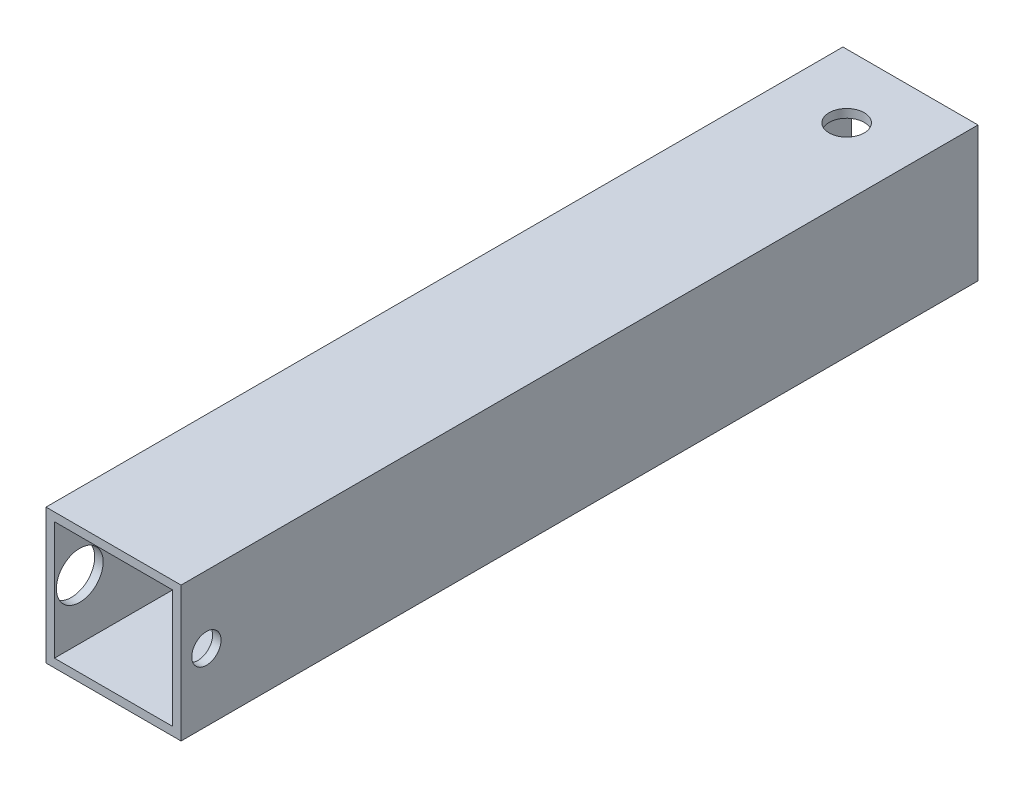
ISO-10303-21;
HEADER;
FILE_DESCRIPTION(('STEP AP214'),'2;1');
FILE_NAME('part.step','',(''),(''),'','','');
FILE_SCHEMA(('AUTOMOTIVE_DESIGN { 1 0 10303 214 1 1 1 1 }'));
ENDSEC;
DATA;
#1=APPLICATION_CONTEXT('core data for automotive mechanical design processes');
#2=APPLICATION_PROTOCOL_DEFINITION('international standard','automotive_design',2000,#1);
#3=PRODUCT_CONTEXT('',#1,'mechanical');
#4=PRODUCT('Part','Part','',(#3));
#5=PRODUCT_RELATED_PRODUCT_CATEGORY('part','',(#4));
#6=PRODUCT_DEFINITION_FORMATION('','',#4);
#7=PRODUCT_DEFINITION_CONTEXT('part definition',#1,'design');
#8=PRODUCT_DEFINITION('design','',#6,#7);
#9=PRODUCT_DEFINITION_SHAPE('','',#8);
#10=(LENGTH_UNIT() NAMED_UNIT(*) SI_UNIT(.MILLI.,.METRE.));
#11=(NAMED_UNIT(*) PLANE_ANGLE_UNIT() SI_UNIT($,.RADIAN.));
#12=(NAMED_UNIT(*) SI_UNIT($,.STERADIAN.) SOLID_ANGLE_UNIT());
#13=UNCERTAINTY_MEASURE_WITH_UNIT(LENGTH_MEASURE(1.E-05),#10,'distance_accuracy_value','');
#14=(GEOMETRIC_REPRESENTATION_CONTEXT(3) GLOBAL_UNCERTAINTY_ASSIGNED_CONTEXT((#13)) GLOBAL_UNIT_ASSIGNED_CONTEXT((#10,
#11,#12)) REPRESENTATION_CONTEXT('',''));
#15=CARTESIAN_POINT('',(0.,0.,0.));
#16=DIRECTION('',(0.,0.,1.));
#17=DIRECTION('',(1.,0.,0.));
#18=AXIS2_PLACEMENT_3D('',#15,#16,#17);
#19=CARTESIAN_POINT('',(0.,0.,74.93));
#20=DIRECTION('',(0.,0.,-1.));
#21=DIRECTION('',(-1.,0.,0.));
#22=AXIS2_PLACEMENT_3D('',#19,#20,#21);
#23=PLANE('',#22);
#24=DIRECTION('',(0.,1.,0.));
#25=VECTOR('',#24,1.);
#26=CARTESIAN_POINT('',(12.7,-12.7,74.93));
#27=LINE('',#26,#25);
#28=CARTESIAN_POINT('',(12.7,-12.7,74.93));
#29=VERTEX_POINT('',#28);
#30=CARTESIAN_POINT('',(12.7,12.7,74.93));
#31=VERTEX_POINT('',#30);
#32=EDGE_CURVE('E147',#29,#31,#27,.T.);
#33=ORIENTED_EDGE('',*,*,#32,.T.);
#34=DIRECTION('',(-1.,0.,0.));
#35=VECTOR('',#34,1.);
#36=CARTESIAN_POINT('',(-12.7,12.7,74.93));
#37=LINE('',#36,#35);
#38=CARTESIAN_POINT('',(-12.7,12.7,74.93));
#39=VERTEX_POINT('',#38);
#40=EDGE_CURVE('E150',#31,#39,#37,.T.);
#41=ORIENTED_EDGE('',*,*,#40,.T.);
#42=DIRECTION('',(0.,-1.,0.));
#43=VECTOR('',#42,1.);
#44=CARTESIAN_POINT('',(-12.7,-12.7,74.93));
#45=LINE('',#44,#43);
#46=CARTESIAN_POINT('',(-12.7,-12.7,74.93));
#47=VERTEX_POINT('',#46);
#48=EDGE_CURVE('E153',#39,#47,#45,.T.);
#49=ORIENTED_EDGE('',*,*,#48,.T.);
#50=DIRECTION('',(1.,0.,0.));
#51=VECTOR('',#50,1.);
#52=CARTESIAN_POINT('',(-12.7,-12.7,74.93));
#53=LINE('',#52,#51);
#54=EDGE_CURVE('E155',#47,#29,#53,.T.);
#55=ORIENTED_EDGE('',*,*,#54,.T.);
#56=EDGE_LOOP('',(#33,#41,#49,#55));
#57=FACE_BOUND('',#56,.T.);
#58=DIRECTION('',(0.,1.,0.));
#59=VECTOR('',#58,1.);
#60=CARTESIAN_POINT('',(11.1125,0.,74.93));
#61=LINE('',#60,#59);
#62=CARTESIAN_POINT('',(11.1125,-11.1125,74.93));
#63=VERTEX_POINT('',#62);
#64=CARTESIAN_POINT('',(11.1125,11.1125,74.93));
#65=VERTEX_POINT('',#64);
#66=EDGE_CURVE('E135',#63,#65,#61,.T.);
#67=ORIENTED_EDGE('',*,*,#66,.F.);
#68=DIRECTION('',(1.,0.,0.));
#69=VECTOR('',#68,1.);
#70=CARTESIAN_POINT('',(0.,-11.1125,74.93));
#71=LINE('',#70,#69);
#72=CARTESIAN_POINT('',(-11.1125,-11.1125,74.93));
#73=VERTEX_POINT('',#72);
#74=EDGE_CURVE('E119',#73,#63,#71,.T.);
#75=ORIENTED_EDGE('',*,*,#74,.F.);
#76=DIRECTION('',(0.,-1.,0.));
#77=VECTOR('',#76,1.);
#78=CARTESIAN_POINT('',(-11.1125,0.,74.93));
#79=LINE('',#78,#77);
#80=CARTESIAN_POINT('',(-11.1125,11.1125,74.93));
#81=VERTEX_POINT('',#80);
#82=EDGE_CURVE('E144',#81,#73,#79,.T.);
#83=ORIENTED_EDGE('',*,*,#82,.F.);
#84=DIRECTION('',(-1.,0.,0.));
#85=VECTOR('',#84,1.);
#86=CARTESIAN_POINT('',(0.,11.1125,74.93));
#87=LINE('',#86,#85);
#88=EDGE_CURVE('E137',#65,#81,#87,.T.);
#89=ORIENTED_EDGE('',*,*,#88,.F.);
#90=EDGE_LOOP('',(#67,#75,#83,#89));
#91=FACE_BOUND('',#90,.T.);
#92=ADVANCED_FACE('F47',(#57,#91),#23,.F.);
#93=CARTESIAN_POINT('',(0.,0.,-74.93));
#94=DIRECTION('',(0.,0.,-1.));
#95=DIRECTION('',(-1.,0.,0.));
#96=AXIS2_PLACEMENT_3D('',#93,#94,#95);
#97=PLANE('',#96);
#98=DIRECTION('',(0.,1.,0.));
#99=VECTOR('',#98,1.);
#100=CARTESIAN_POINT('',(12.7,-12.7,-74.93));
#101=LINE('',#100,#99);
#102=CARTESIAN_POINT('',(12.7,-12.7,-74.93));
#103=VERTEX_POINT('',#102);
#104=CARTESIAN_POINT('',(12.7,12.7,-74.93));
#105=VERTEX_POINT('',#104);
#106=EDGE_CURVE('E158',#103,#105,#101,.T.);
#107=ORIENTED_EDGE('',*,*,#106,.F.);
#108=DIRECTION('',(1.,0.,0.));
#109=VECTOR('',#108,1.);
#110=CARTESIAN_POINT('',(-12.7,-12.7,-74.93));
#111=LINE('',#110,#109);
#112=CARTESIAN_POINT('',(-12.7,-12.7,-74.93));
#113=VERTEX_POINT('',#112);
#114=EDGE_CURVE('E151',#113,#103,#111,.T.);
#115=ORIENTED_EDGE('',*,*,#114,.F.);
#116=DIRECTION('',(0.,-1.,0.));
#117=VECTOR('',#116,1.);
#118=CARTESIAN_POINT('',(-12.7,-12.7,-74.93));
#119=LINE('',#118,#117);
#120=CARTESIAN_POINT('',(-12.7,12.7,-74.93));
#121=VERTEX_POINT('',#120);
#122=EDGE_CURVE('E163',#121,#113,#119,.T.);
#123=ORIENTED_EDGE('',*,*,#122,.F.);
#124=DIRECTION('',(-1.,0.,0.));
#125=VECTOR('',#124,1.);
#126=CARTESIAN_POINT('',(-12.7,12.7,-74.93));
#127=LINE('',#126,#125);
#128=EDGE_CURVE('E161',#105,#121,#127,.T.);
#129=ORIENTED_EDGE('',*,*,#128,.F.);
#130=EDGE_LOOP('',(#107,#115,#123,#129));
#131=FACE_BOUND('',#130,.T.);
#132=DIRECTION('',(1.,0.,0.));
#133=VECTOR('',#132,1.);
#134=CARTESIAN_POINT('',(0.,-11.1125,-74.93));
#135=LINE('',#134,#133);
#136=CARTESIAN_POINT('',(-11.1125,-11.1125,-74.93));
#137=VERTEX_POINT('',#136);
#138=CARTESIAN_POINT('',(11.1125,-11.1125,-74.93));
#139=VERTEX_POINT('',#138);
#140=EDGE_CURVE('E117',#137,#139,#135,.T.);
#141=ORIENTED_EDGE('',*,*,#140,.T.);
#142=DIRECTION('',(0.,1.,0.));
#143=VECTOR('',#142,1.);
#144=CARTESIAN_POINT('',(11.1125,0.,-74.93));
#145=LINE('',#144,#143);
#146=CARTESIAN_POINT('',(11.1125,11.1125,-74.93));
#147=VERTEX_POINT('',#146);
#148=EDGE_CURVE('E125',#139,#147,#145,.T.);
#149=ORIENTED_EDGE('',*,*,#148,.T.);
#150=DIRECTION('',(-1.,0.,0.));
#151=VECTOR('',#150,1.);
#152=CARTESIAN_POINT('',(0.,11.1125,-74.93));
#153=LINE('',#152,#151);
#154=CARTESIAN_POINT('',(-11.1125,11.1125,-74.93));
#155=VERTEX_POINT('',#154);
#156=EDGE_CURVE('E131',#147,#155,#153,.T.);
#157=ORIENTED_EDGE('',*,*,#156,.T.);
#158=DIRECTION('',(0.,-1.,0.));
#159=VECTOR('',#158,1.);
#160=CARTESIAN_POINT('',(-11.1125,0.,-74.93));
#161=LINE('',#160,#159);
#162=EDGE_CURVE('E71',#155,#137,#161,.T.);
#163=ORIENTED_EDGE('',*,*,#162,.T.);
#164=EDGE_LOOP('',(#141,#149,#157,#163));
#165=FACE_BOUND('',#164,.T.);
#166=ADVANCED_FACE('F134',(#131,#165),#97,.T.);
#167=CARTESIAN_POINT('',(12.7,-12.7,74.93));
#168=DIRECTION('',(-1.,0.,0.));
#169=DIRECTION('',(0.,0.,1.));
#170=AXIS2_PLACEMENT_3D('',#167,#168,#169);
#171=PLANE('',#170);
#172=CARTESIAN_POINT('',(12.7,0.,70.1675));
#173=DIRECTION('',(-1.,0.,0.));
#174=DIRECTION('',(0.,0.,1.));
#175=AXIS2_PLACEMENT_3D('',#172,#173,#174);
#176=CIRCLE('',#175,2.74999999999999);
#177=CARTESIAN_POINT('',(12.7,0.,72.9175));
#178=VERTEX_POINT('',#177);
#179=EDGE_CURVE('E174',#178,#178,#176,.T.);
#180=ORIENTED_EDGE('',*,*,#179,.T.);
#181=EDGE_LOOP('',(#180));
#182=FACE_BOUND('',#181,.T.);
#183=ORIENTED_EDGE('',*,*,#106,.T.);
#184=DIRECTION('',(0.,0.,-1.));
#185=VECTOR('',#184,1.);
#186=CARTESIAN_POINT('',(12.7,12.7,74.93));
#187=LINE('',#186,#185);
#188=EDGE_CURVE('E13',#31,#105,#187,.T.);
#189=ORIENTED_EDGE('',*,*,#188,.F.);
#190=ORIENTED_EDGE('',*,*,#32,.F.);
#191=DIRECTION('',(0.,0.,-1.));
#192=VECTOR('',#191,1.);
#193=CARTESIAN_POINT('',(12.7,-12.7,74.93));
#194=LINE('',#193,#192);
#195=EDGE_CURVE('E157',#29,#103,#194,.T.);
#196=ORIENTED_EDGE('',*,*,#195,.T.);
#197=EDGE_LOOP('',(#183,#189,#190,#196));
#198=FACE_BOUND('',#197,.T.);
#199=ADVANCED_FACE('F49',(#182,#198),#171,.F.);
#200=CARTESIAN_POINT('',(-12.7,12.7,74.93));
#201=DIRECTION('',(0.,-1.,0.));
#202=DIRECTION('',(0.,0.,-1.));
#203=AXIS2_PLACEMENT_3D('',#200,#201,#202);
#204=PLANE('',#203);
#205=CARTESIAN_POINT('',(0.,12.7,-62.93));
#206=DIRECTION('',(0.,-1.,0.));
#207=DIRECTION('',(0.,0.,-1.));
#208=AXIS2_PLACEMENT_3D('',#205,#206,#207);
#209=CIRCLE('',#208,3.29999999999999);
#210=CARTESIAN_POINT('',(0.,12.7,-66.23));
#211=VERTEX_POINT('',#210);
#212=EDGE_CURVE('E237',#211,#211,#209,.T.);
#213=ORIENTED_EDGE('',*,*,#212,.T.);
#214=EDGE_LOOP('',(#213));
#215=FACE_BOUND('',#214,.T.);
#216=ORIENTED_EDGE('',*,*,#128,.T.);
#217=DIRECTION('',(0.,0.,-1.));
#218=VECTOR('',#217,1.);
#219=CARTESIAN_POINT('',(-12.7,12.7,74.93));
#220=LINE('',#219,#218);
#221=EDGE_CURVE('E56',#39,#121,#220,.T.);
#222=ORIENTED_EDGE('',*,*,#221,.F.);
#223=ORIENTED_EDGE('',*,*,#40,.F.);
#224=ORIENTED_EDGE('',*,*,#188,.T.);
#225=EDGE_LOOP('',(#216,#222,#223,#224));
#226=FACE_BOUND('',#225,.T.);
#227=ADVANCED_FACE('F226',(#215,#226),#204,.F.);
#228=CARTESIAN_POINT('',(-12.7,-12.7,74.93));
#229=DIRECTION('',(1.,0.,0.));
#230=DIRECTION('',(0.,0.,-1.));
#231=AXIS2_PLACEMENT_3D('',#228,#229,#230);
#232=PLANE('',#231);
#233=CARTESIAN_POINT('',(-12.7,0.,70.1675));
#234=DIRECTION('',(-1.,0.,0.));
#235=DIRECTION('',(0.,0.,1.));
#236=AXIS2_PLACEMENT_3D('',#233,#234,#235);
#237=CIRCLE('',#236,4.4);
#238=CARTESIAN_POINT('',(-12.7,0.,74.5675));
#239=VERTEX_POINT('',#238);
#240=EDGE_CURVE('E180',#239,#239,#237,.T.);
#241=ORIENTED_EDGE('',*,*,#240,.F.);
#242=EDGE_LOOP('',(#241));
#243=FACE_BOUND('',#242,.T.);
#244=ORIENTED_EDGE('',*,*,#122,.T.);
#245=DIRECTION('',(0.,0.,-1.));
#246=VECTOR('',#245,1.);
#247=CARTESIAN_POINT('',(-12.7,-12.7,74.93));
#248=LINE('',#247,#246);
#249=EDGE_CURVE('E168',#47,#113,#248,.T.);
#250=ORIENTED_EDGE('',*,*,#249,.F.);
#251=ORIENTED_EDGE('',*,*,#48,.F.);
#252=ORIENTED_EDGE('',*,*,#221,.T.);
#253=EDGE_LOOP('',(#244,#250,#251,#252));
#254=FACE_BOUND('',#253,.T.);
#255=ADVANCED_FACE('F223',(#243,#254),#232,.F.);
#256=CARTESIAN_POINT('',(-12.7,-12.7,74.93));
#257=DIRECTION('',(0.,1.,0.));
#258=DIRECTION('',(0.,0.,1.));
#259=AXIS2_PLACEMENT_3D('',#256,#257,#258);
#260=PLANE('',#259);
#261=CARTESIAN_POINT('',(0.,-12.7,-62.93));
#262=DIRECTION('',(0.,-1.,0.));
#263=DIRECTION('',(0.,0.,-1.));
#264=AXIS2_PLACEMENT_3D('',#261,#262,#263);
#265=CIRCLE('',#264,3.29999999999999);
#266=CARTESIAN_POINT('',(0.,-12.7,-66.23));
#267=VERTEX_POINT('',#266);
#268=EDGE_CURVE('E252',#267,#267,#265,.T.);
#269=ORIENTED_EDGE('',*,*,#268,.F.);
#270=EDGE_LOOP('',(#269));
#271=FACE_BOUND('',#270,.T.);
#272=ORIENTED_EDGE('',*,*,#114,.T.);
#273=ORIENTED_EDGE('',*,*,#195,.F.);
#274=ORIENTED_EDGE('',*,*,#54,.F.);
#275=ORIENTED_EDGE('',*,*,#249,.T.);
#276=EDGE_LOOP('',(#272,#273,#274,#275));
#277=FACE_BOUND('',#276,.T.);
#278=ADVANCED_FACE('F208',(#271,#277),#260,.F.);
#279=CARTESIAN_POINT('',(11.1125,-12.7,74.93));
#280=DIRECTION('',(-1.,0.,0.));
#281=DIRECTION('',(0.,0.,1.));
#282=AXIS2_PLACEMENT_3D('',#279,#280,#281);
#283=PLANE('',#282);
#284=CARTESIAN_POINT('',(11.1125,0.,70.1675));
#285=DIRECTION('',(-1.,0.,0.));
#286=DIRECTION('',(0.,0.,1.));
#287=AXIS2_PLACEMENT_3D('',#284,#285,#286);
#288=CIRCLE('',#287,2.75);
#289=CARTESIAN_POINT('',(11.1125,0.,72.9175));
#290=VERTEX_POINT('',#289);
#291=EDGE_CURVE('E172',#290,#290,#288,.T.);
#292=ORIENTED_EDGE('',*,*,#291,.F.);
#293=EDGE_LOOP('',(#292));
#294=FACE_BOUND('',#293,.T.);
#295=ORIENTED_EDGE('',*,*,#148,.F.);
#296=DIRECTION('',(0.,0.,-1.));
#297=VECTOR('',#296,1.);
#298=CARTESIAN_POINT('',(11.1125,-11.1125,74.93));
#299=LINE('',#298,#297);
#300=EDGE_CURVE('E113',#63,#139,#299,.T.);
#301=ORIENTED_EDGE('',*,*,#300,.F.);
#302=ORIENTED_EDGE('',*,*,#66,.T.);
#303=DIRECTION('',(0.,0.,-1.));
#304=VECTOR('',#303,1.);
#305=CARTESIAN_POINT('',(11.1125,11.1125,74.93));
#306=LINE('',#305,#304);
#307=EDGE_CURVE('E128',#65,#147,#306,.T.);
#308=ORIENTED_EDGE('',*,*,#307,.T.);
#309=EDGE_LOOP('',(#295,#301,#302,#308));
#310=FACE_BOUND('',#309,.T.);
#311=ADVANCED_FACE('F126',(#294,#310),#283,.T.);
#312=CARTESIAN_POINT('',(-12.7,11.1125,74.93));
#313=DIRECTION('',(0.,-1.,0.));
#314=DIRECTION('',(0.,0.,-1.));
#315=AXIS2_PLACEMENT_3D('',#312,#313,#314);
#316=PLANE('',#315);
#317=CARTESIAN_POINT('',(0.,11.1125,-62.93));
#318=DIRECTION('',(0.,-1.,0.));
#319=DIRECTION('',(0.,0.,-1.));
#320=AXIS2_PLACEMENT_3D('',#317,#318,#319);
#321=CIRCLE('',#320,3.29999999999999);
#322=CARTESIAN_POINT('',(0.,11.1125,-66.23));
#323=VERTEX_POINT('',#322);
#324=EDGE_CURVE('E185',#323,#323,#321,.T.);
#325=ORIENTED_EDGE('',*,*,#324,.F.);
#326=EDGE_LOOP('',(#325));
#327=FACE_BOUND('',#326,.T.);
#328=ORIENTED_EDGE('',*,*,#156,.F.);
#329=ORIENTED_EDGE('',*,*,#307,.F.);
#330=ORIENTED_EDGE('',*,*,#88,.T.);
#331=DIRECTION('',(0.,0.,-1.));
#332=VECTOR('',#331,1.);
#333=CARTESIAN_POINT('',(-11.1125,11.1125,74.93));
#334=LINE('',#333,#332);
#335=EDGE_CURVE('E189',#81,#155,#334,.T.);
#336=ORIENTED_EDGE('',*,*,#335,.T.);
#337=EDGE_LOOP('',(#328,#329,#330,#336));
#338=FACE_BOUND('',#337,.T.);
#339=ADVANCED_FACE('F196',(#327,#338),#316,.T.);
#340=CARTESIAN_POINT('',(-11.1125,-12.7,74.93));
#341=DIRECTION('',(1.,0.,0.));
#342=DIRECTION('',(0.,0.,-1.));
#343=AXIS2_PLACEMENT_3D('',#340,#341,#342);
#344=PLANE('',#343);
#345=CARTESIAN_POINT('',(-11.1125,0.,70.1675));
#346=DIRECTION('',(1.,0.,0.));
#347=DIRECTION('',(0.,0.,-1.));
#348=AXIS2_PLACEMENT_3D('',#345,#346,#347);
#349=CIRCLE('',#348,4.4);
#350=CARTESIAN_POINT('',(-11.1125,0.,65.7675));
#351=VERTEX_POINT('',#350);
#352=EDGE_CURVE('E132',#351,#351,#349,.T.);
#353=ORIENTED_EDGE('',*,*,#352,.F.);
#354=EDGE_LOOP('',(#353));
#355=FACE_BOUND('',#354,.T.);
#356=ORIENTED_EDGE('',*,*,#162,.F.);
#357=ORIENTED_EDGE('',*,*,#335,.F.);
#358=ORIENTED_EDGE('',*,*,#82,.T.);
#359=DIRECTION('',(0.,0.,-1.));
#360=VECTOR('',#359,1.);
#361=CARTESIAN_POINT('',(-11.1125,-11.1125,74.93));
#362=LINE('',#361,#360);
#363=EDGE_CURVE('E64',#73,#137,#362,.T.);
#364=ORIENTED_EDGE('',*,*,#363,.T.);
#365=EDGE_LOOP('',(#356,#357,#358,#364));
#366=FACE_BOUND('',#365,.T.);
#367=ADVANCED_FACE('F191',(#355,#366),#344,.T.);
#368=CARTESIAN_POINT('',(-12.7,-11.1125,74.93));
#369=DIRECTION('',(0.,1.,0.));
#370=DIRECTION('',(0.,0.,1.));
#371=AXIS2_PLACEMENT_3D('',#368,#369,#370);
#372=PLANE('',#371);
#373=CARTESIAN_POINT('',(0.,-11.1125,-62.93));
#374=DIRECTION('',(0.,1.,0.));
#375=DIRECTION('',(0.,0.,1.));
#376=AXIS2_PLACEMENT_3D('',#373,#374,#375);
#377=CIRCLE('',#376,3.29999999999999);
#378=CARTESIAN_POINT('',(0.,-11.1125,-59.63));
#379=VERTEX_POINT('',#378);
#380=EDGE_CURVE('E51',#379,#379,#377,.T.);
#381=ORIENTED_EDGE('',*,*,#380,.F.);
#382=EDGE_LOOP('',(#381));
#383=FACE_BOUND('',#382,.T.);
#384=ORIENTED_EDGE('',*,*,#140,.F.);
#385=ORIENTED_EDGE('',*,*,#363,.F.);
#386=ORIENTED_EDGE('',*,*,#74,.T.);
#387=ORIENTED_EDGE('',*,*,#300,.T.);
#388=EDGE_LOOP('',(#384,#385,#386,#387));
#389=FACE_BOUND('',#388,.T.);
#390=ADVANCED_FACE('F115',(#383,#389),#372,.T.);
#391=CARTESIAN_POINT('',(-12.7,0.,70.1675));
#392=DIRECTION('',(-1.,0.,0.));
#393=DIRECTION('',(0.,0.,1.));
#394=AXIS2_PLACEMENT_3D('',#391,#392,#393);
#395=CYLINDRICAL_SURFACE('',#394,2.75);
#396=ORIENTED_EDGE('',*,*,#291,.T.);
#397=EDGE_LOOP('',(#396));
#398=FACE_BOUND('',#397,.T.);
#399=ORIENTED_EDGE('',*,*,#179,.F.);
#400=EDGE_LOOP('',(#399));
#401=FACE_BOUND('',#400,.T.);
#402=ADVANCED_FACE('F271',(#398,#401),#395,.F.);
#403=CARTESIAN_POINT('',(-12.7,0.,70.1675));
#404=DIRECTION('',(-1.,0.,0.));
#405=DIRECTION('',(0.,0.,1.));
#406=AXIS2_PLACEMENT_3D('',#403,#404,#405);
#407=CYLINDRICAL_SURFACE('',#406,4.4);
#408=ORIENTED_EDGE('',*,*,#352,.T.);
#409=EDGE_LOOP('',(#408));
#410=FACE_BOUND('',#409,.T.);
#411=ORIENTED_EDGE('',*,*,#240,.T.);
#412=EDGE_LOOP('',(#411));
#413=FACE_BOUND('',#412,.T.);
#414=ADVANCED_FACE('F266',(#410,#413),#407,.F.);
#415=CARTESIAN_POINT('',(0.,-12.7,-62.93));
#416=DIRECTION('',(0.,-1.,0.));
#417=DIRECTION('',(0.,0.,-1.));
#418=AXIS2_PLACEMENT_3D('',#415,#416,#417);
#419=CYLINDRICAL_SURFACE('',#418,3.29999999999999);
#420=ORIENTED_EDGE('',*,*,#380,.T.);
#421=EDGE_LOOP('',(#420));
#422=FACE_BOUND('',#421,.T.);
#423=ORIENTED_EDGE('',*,*,#268,.T.);
#424=EDGE_LOOP('',(#423));
#425=FACE_BOUND('',#424,.T.);
#426=ADVANCED_FACE('F261',(#422,#425),#419,.F.);
#427=ORIENTED_EDGE('',*,*,#324,.T.);
#428=EDGE_LOOP('',(#427));
#429=FACE_BOUND('',#428,.T.);
#430=ORIENTED_EDGE('',*,*,#212,.F.);
#431=EDGE_LOOP('',(#430));
#432=FACE_BOUND('',#431,.T.);
#433=ADVANCED_FACE('F259',(#429,#432),#419,.F.);
#434=CLOSED_SHELL('',(#92,#166,#199,#227,#255,#278,#311,#339,#367,#390,#402,#414,#426,#433));
#435=MANIFOLD_SOLID_BREP('B2',#434);
#436=ADVANCED_BREP_SHAPE_REPRESENTATION('',(#18,#435),#14);
#437=SHAPE_DEFINITION_REPRESENTATION(#9,#436);
ENDSEC;
END-ISO-10303-21;
